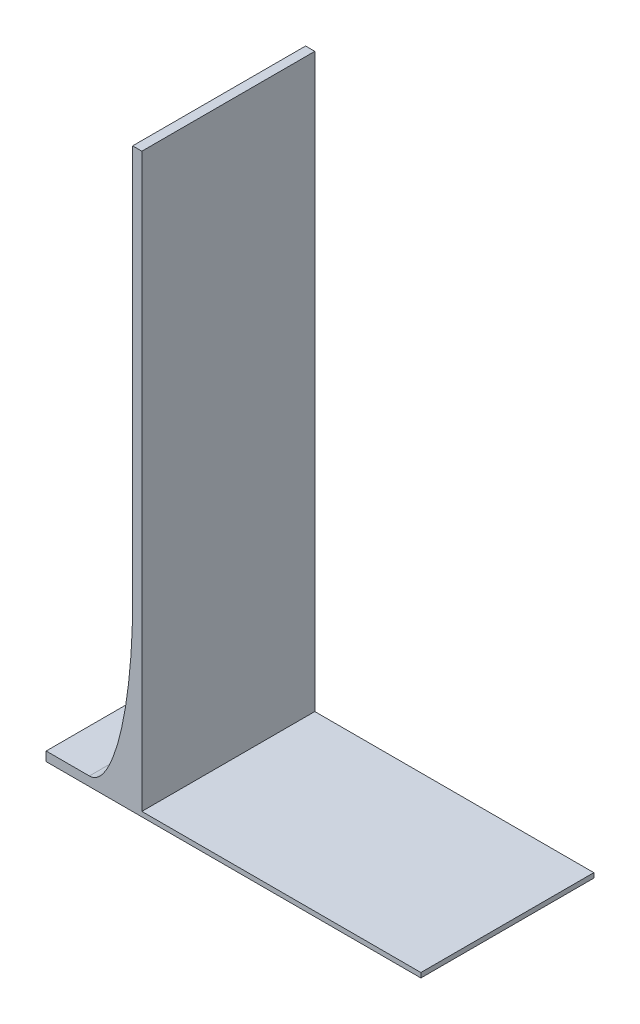
ISO-10303-21;
HEADER;
FILE_DESCRIPTION(('STEP AP214'),'2;1');
FILE_NAME('part.step','',(''),(''),'','','');
FILE_SCHEMA(('AUTOMOTIVE_DESIGN { 1 0 10303 214 1 1 1 1 }'));
ENDSEC;
DATA;
#1=APPLICATION_CONTEXT('core data for automotive mechanical design processes');
#2=APPLICATION_PROTOCOL_DEFINITION('international standard','automotive_design',2000,#1);
#3=PRODUCT_CONTEXT('',#1,'mechanical');
#4=PRODUCT('Part','Part','',(#3));
#5=PRODUCT_RELATED_PRODUCT_CATEGORY('part','',(#4));
#6=PRODUCT_DEFINITION_FORMATION('','',#4);
#7=PRODUCT_DEFINITION_CONTEXT('part definition',#1,'design');
#8=PRODUCT_DEFINITION('design','',#6,#7);
#9=PRODUCT_DEFINITION_SHAPE('','',#8);
#10=(LENGTH_UNIT() NAMED_UNIT(*) SI_UNIT(.MILLI.,.METRE.));
#11=(NAMED_UNIT(*) PLANE_ANGLE_UNIT() SI_UNIT($,.RADIAN.));
#12=(NAMED_UNIT(*) SI_UNIT($,.STERADIAN.) SOLID_ANGLE_UNIT());
#13=UNCERTAINTY_MEASURE_WITH_UNIT(LENGTH_MEASURE(1.E-05),#10,'distance_accuracy_value','');
#14=(GEOMETRIC_REPRESENTATION_CONTEXT(3) GLOBAL_UNCERTAINTY_ASSIGNED_CONTEXT((#13)) GLOBAL_UNIT_ASSIGNED_CONTEXT((#10,
#11,#12)) REPRESENTATION_CONTEXT('',''));
#15=CARTESIAN_POINT('',(0.,0.,0.));
#16=DIRECTION('',(0.,0.,1.));
#17=DIRECTION('',(1.,0.,0.));
#18=AXIS2_PLACEMENT_3D('',#15,#16,#17);
#19=CARTESIAN_POINT('',(0.,1.65,60.));
#20=DIRECTION('',(0.,1.,0.));
#21=DIRECTION('',(0.,0.,1.));
#22=AXIS2_PLACEMENT_3D('',#19,#20,#21);
#23=PLANE('',#22);
#24=DIRECTION('',(1.,0.,0.));
#25=VECTOR('',#24,1.);
#26=CARTESIAN_POINT('',(0.,1.65,0.));
#27=LINE('',#26,#25);
#28=CARTESIAN_POINT('',(3.2,1.65,0.));
#29=VERTEX_POINT('',#28);
#30=CARTESIAN_POINT('',(100.,1.65,0.));
#31=VERTEX_POINT('',#30);
#32=EDGE_CURVE('E256',#29,#31,#27,.T.);
#33=ORIENTED_EDGE('',*,*,#32,.F.);
#34=DIRECTION('',(0.,0.,1.));
#35=VECTOR('',#34,1.);
#36=CARTESIAN_POINT('',(3.2,1.65,60.));
#37=LINE('',#36,#35);
#38=CARTESIAN_POINT('',(3.2,1.65,60.));
#39=VERTEX_POINT('',#38);
#40=EDGE_CURVE('E163',#29,#39,#37,.T.);
#41=ORIENTED_EDGE('',*,*,#40,.T.);
#42=DIRECTION('',(1.,0.,0.));
#43=VECTOR('',#42,1.);
#44=CARTESIAN_POINT('',(0.,1.65,60.));
#45=LINE('',#44,#43);
#46=CARTESIAN_POINT('',(100.,1.65,60.));
#47=VERTEX_POINT('',#46);
#48=EDGE_CURVE('E262',#39,#47,#45,.T.);
#49=ORIENTED_EDGE('',*,*,#48,.T.);
#50=DIRECTION('',(0.,0.,-1.));
#51=VECTOR('',#50,1.);
#52=CARTESIAN_POINT('',(100.,1.65,60.));
#53=LINE('',#52,#51);
#54=EDGE_CURVE('E253',#47,#31,#53,.T.);
#55=ORIENTED_EDGE('',*,*,#54,.T.);
#56=EDGE_LOOP('',(#33,#41,#49,#55));
#57=FACE_BOUND('',#56,.T.);
#58=ADVANCED_FACE('F66',(#57),#23,.T.);
#59=CARTESIAN_POINT('',(0.,0.,60.));
#60=DIRECTION('',(0.,1.,0.));
#61=DIRECTION('',(0.,0.,1.));
#62=AXIS2_PLACEMENT_3D('',#59,#60,#61);
#63=PLANE('',#62);
#64=DIRECTION('',(1.,0.,0.));
#65=VECTOR('',#64,1.);
#66=CARTESIAN_POINT('',(0.,0.,0.));
#67=LINE('',#66,#65);
#68=CARTESIAN_POINT('',(-30.,0.,0.));
#69=VERTEX_POINT('',#68);
#70=CARTESIAN_POINT('',(100.,0.,0.));
#71=VERTEX_POINT('',#70);
#72=EDGE_CURVE('E243',#69,#71,#67,.T.);
#73=ORIENTED_EDGE('',*,*,#72,.T.);
#74=DIRECTION('',(0.,0.,-1.));
#75=VECTOR('',#74,1.);
#76=CARTESIAN_POINT('',(100.,0.,60.));
#77=LINE('',#76,#75);
#78=CARTESIAN_POINT('',(100.,0.,60.));
#79=VERTEX_POINT('',#78);
#80=EDGE_CURVE('E179',#79,#71,#77,.T.);
#81=ORIENTED_EDGE('',*,*,#80,.F.);
#82=DIRECTION('',(1.,0.,0.));
#83=VECTOR('',#82,1.);
#84=CARTESIAN_POINT('',(0.,0.,60.));
#85=LINE('',#84,#83);
#86=CARTESIAN_POINT('',(-30.,0.,60.));
#87=VERTEX_POINT('',#86);
#88=EDGE_CURVE('E259',#87,#79,#85,.T.);
#89=ORIENTED_EDGE('',*,*,#88,.F.);
#90=DIRECTION('',(0.,0.,-1.));
#91=VECTOR('',#90,1.);
#92=CARTESIAN_POINT('',(-30.,0.,60.));
#93=LINE('',#92,#91);
#94=EDGE_CURVE('E164',#87,#69,#93,.T.);
#95=ORIENTED_EDGE('',*,*,#94,.T.);
#96=EDGE_LOOP('',(#73,#81,#89,#95));
#97=FACE_BOUND('',#96,.T.);
#98=ADVANCED_FACE('F233',(#97),#63,.F.);
#99=CARTESIAN_POINT('',(100.,1.65,60.));
#100=DIRECTION('',(1.,0.,0.));
#101=DIRECTION('',(0.,0.,-1.));
#102=AXIS2_PLACEMENT_3D('',#99,#100,#101);
#103=PLANE('',#102);
#104=DIRECTION('',(0.,-1.,0.));
#105=VECTOR('',#104,1.);
#106=CARTESIAN_POINT('',(100.,1.65,0.));
#107=LINE('',#106,#105);
#108=EDGE_CURVE('E247',#31,#71,#107,.T.);
#109=ORIENTED_EDGE('',*,*,#108,.F.);
#110=ORIENTED_EDGE('',*,*,#54,.F.);
#111=DIRECTION('',(0.,-1.,0.));
#112=VECTOR('',#111,1.);
#113=CARTESIAN_POINT('',(100.,1.65,60.));
#114=LINE('',#113,#112);
#115=EDGE_CURVE('E252',#47,#79,#114,.T.);
#116=ORIENTED_EDGE('',*,*,#115,.T.);
#117=ORIENTED_EDGE('',*,*,#80,.T.);
#118=EDGE_LOOP('',(#109,#110,#116,#117));
#119=FACE_BOUND('',#118,.T.);
#120=ADVANCED_FACE('F235',(#119),#103,.T.);
#121=CARTESIAN_POINT('',(0.,0.,60.));
#122=DIRECTION('',(0.,0.,-1.));
#123=DIRECTION('',(-1.,0.,0.));
#124=AXIS2_PLACEMENT_3D('',#121,#122,#123);
#125=PLANE('',#124);
#126=ORIENTED_EDGE('',*,*,#48,.F.);
#127=DIRECTION('',(0.,1.,0.));
#128=VECTOR('',#127,1.);
#129=CARTESIAN_POINT('',(3.2,0.,60.));
#130=LINE('',#129,#128);
#131=CARTESIAN_POINT('',(3.2,200.,60.));
#132=VERTEX_POINT('',#131);
#133=EDGE_CURVE('E278',#39,#132,#130,.T.);
#134=ORIENTED_EDGE('',*,*,#133,.T.);
#135=DIRECTION('',(1.,0.,0.));
#136=VECTOR('',#135,1.);
#137=CARTESIAN_POINT('',(0.,200.,60.));
#138=LINE('',#137,#136);
#139=CARTESIAN_POINT('',(0.,200.,60.));
#140=VERTEX_POINT('',#139);
#141=EDGE_CURVE('E280',#140,#132,#138,.T.);
#142=ORIENTED_EDGE('',*,*,#141,.F.);
#143=DIRECTION('',(0.,1.,0.));
#144=VECTOR('',#143,1.);
#145=CARTESIAN_POINT('',(0.,0.,60.));
#146=LINE('',#145,#144);
#147=CARTESIAN_POINT('',(0.,63.2,60.));
#148=VERTEX_POINT('',#147);
#149=EDGE_CURVE('E188',#148,#140,#146,.T.);
#150=ORIENTED_EDGE('',*,*,#149,.F.);
#151=CARTESIAN_POINT('',(-15.,3.2,60.));
#152=CARTESIAN_POINT('',(0.,3.2,60.));
#153=CARTESIAN_POINT('',(0.,63.2,60.));
#154=(BOUNDED_CURVE() B_SPLINE_CURVE(2,(#151,#152,#153),.UNSPECIFIED.,.F.,
.F.) B_SPLINE_CURVE_WITH_KNOTS((3,3),(0.,1.),
.UNSPECIFIED.) CURVE() GEOMETRIC_REPRESENTATION_ITEM() RATIONAL_B_SPLINE_CURVE((1.,
0.707106781186548,1.)) REPRESENTATION_ITEM(''));
#155=CARTESIAN_POINT('',(-15.,3.2,60.));
#156=VERTEX_POINT('',#155);
#157=EDGE_CURVE('E13',#148,#156,#154,.F.);
#158=ORIENTED_EDGE('',*,*,#157,.T.);
#159=DIRECTION('',(-1.,0.,0.));
#160=VECTOR('',#159,1.);
#161=CARTESIAN_POINT('',(0.,3.2,60.));
#162=LINE('',#161,#160);
#163=CARTESIAN_POINT('',(-30.,3.2,60.));
#164=VERTEX_POINT('',#163);
#165=EDGE_CURVE('E143',#156,#164,#162,.T.);
#166=ORIENTED_EDGE('',*,*,#165,.T.);
#167=DIRECTION('',(0.,1.,0.));
#168=VECTOR('',#167,1.);
#169=CARTESIAN_POINT('',(-30.,0.,60.));
#170=LINE('',#169,#168);
#171=EDGE_CURVE('E148',#87,#164,#170,.T.);
#172=ORIENTED_EDGE('',*,*,#171,.F.);
#173=ORIENTED_EDGE('',*,*,#88,.T.);
#174=ORIENTED_EDGE('',*,*,#115,.F.);
#175=EDGE_LOOP('',(#126,#134,#142,#150,#158,#166,#172,#173,#174));
#176=FACE_BOUND('',#175,.T.);
#177=ADVANCED_FACE('F146',(#176),#125,.F.);
#178=CARTESIAN_POINT('',(0.,0.,0.));
#179=DIRECTION('',(0.,0.,-1.));
#180=DIRECTION('',(-1.,0.,0.));
#181=AXIS2_PLACEMENT_3D('',#178,#179,#180);
#182=PLANE('',#181);
#183=DIRECTION('',(0.,1.,0.));
#184=VECTOR('',#183,1.);
#185=CARTESIAN_POINT('',(3.2,0.,0.));
#186=LINE('',#185,#184);
#187=CARTESIAN_POINT('',(3.2,200.,0.));
#188=VERTEX_POINT('',#187);
#189=EDGE_CURVE('E282',#29,#188,#186,.T.);
#190=ORIENTED_EDGE('',*,*,#189,.F.);
#191=ORIENTED_EDGE('',*,*,#32,.T.);
#192=ORIENTED_EDGE('',*,*,#108,.T.);
#193=ORIENTED_EDGE('',*,*,#72,.F.);
#194=DIRECTION('',(0.,1.,0.));
#195=VECTOR('',#194,1.);
#196=CARTESIAN_POINT('',(-30.,0.,0.));
#197=LINE('',#196,#195);
#198=CARTESIAN_POINT('',(-30.,3.2,0.));
#199=VERTEX_POINT('',#198);
#200=EDGE_CURVE('E154',#69,#199,#197,.T.);
#201=ORIENTED_EDGE('',*,*,#200,.T.);
#202=DIRECTION('',(-1.,0.,0.));
#203=VECTOR('',#202,1.);
#204=CARTESIAN_POINT('',(0.,3.2,0.));
#205=LINE('',#204,#203);
#206=CARTESIAN_POINT('',(-15.,3.2,0.));
#207=VERTEX_POINT('',#206);
#208=EDGE_CURVE('E159',#207,#199,#205,.T.);
#209=ORIENTED_EDGE('',*,*,#208,.F.);
#210=CARTESIAN_POINT('',(0.,63.2,0.));
#211=CARTESIAN_POINT('',(0.,3.2,0.));
#212=CARTESIAN_POINT('',(-15.,3.2,0.));
#213=(BOUNDED_CURVE() B_SPLINE_CURVE(2,(#210,#211,#212),.UNSPECIFIED.,.F.,
.F.) B_SPLINE_CURVE_WITH_KNOTS((3,3),(0.,1.),
.UNSPECIFIED.) CURVE() GEOMETRIC_REPRESENTATION_ITEM() RATIONAL_B_SPLINE_CURVE((1.,
0.707106781186548,1.)) REPRESENTATION_ITEM(''));
#214=CARTESIAN_POINT('',(0.,63.2,0.));
#215=VERTEX_POINT('',#214);
#216=EDGE_CURVE('E80',#207,#215,#213,.F.);
#217=ORIENTED_EDGE('',*,*,#216,.T.);
#218=DIRECTION('',(0.,1.,0.));
#219=VECTOR('',#218,1.);
#220=CARTESIAN_POINT('',(0.,0.,0.));
#221=LINE('',#220,#219);
#222=CARTESIAN_POINT('',(0.,200.,0.));
#223=VERTEX_POINT('',#222);
#224=EDGE_CURVE('E277',#215,#223,#221,.T.);
#225=ORIENTED_EDGE('',*,*,#224,.T.);
#226=DIRECTION('',(1.,0.,0.));
#227=VECTOR('',#226,1.);
#228=CARTESIAN_POINT('',(0.,200.,0.));
#229=LINE('',#228,#227);
#230=EDGE_CURVE('E275',#223,#188,#229,.T.);
#231=ORIENTED_EDGE('',*,*,#230,.T.);
#232=EDGE_LOOP('',(#190,#191,#192,#193,#201,#209,#217,#225,#231));
#233=FACE_BOUND('',#232,.T.);
#234=ADVANCED_FACE('F220',(#233),#182,.T.);
#235=CARTESIAN_POINT('',(-30.,0.,60.));
#236=DIRECTION('',(-1.,0.,0.));
#237=DIRECTION('',(0.,0.,1.));
#238=AXIS2_PLACEMENT_3D('',#235,#236,#237);
#239=PLANE('',#238);
#240=ORIENTED_EDGE('',*,*,#200,.F.);
#241=ORIENTED_EDGE('',*,*,#94,.F.);
#242=ORIENTED_EDGE('',*,*,#171,.T.);
#243=DIRECTION('',(0.,0.,-1.));
#244=VECTOR('',#243,1.);
#245=CARTESIAN_POINT('',(-30.,3.2,60.));
#246=LINE('',#245,#244);
#247=EDGE_CURVE('E157',#164,#199,#246,.T.);
#248=ORIENTED_EDGE('',*,*,#247,.T.);
#249=EDGE_LOOP('',(#240,#241,#242,#248));
#250=FACE_BOUND('',#249,.T.);
#251=ADVANCED_FACE('F167',(#250),#239,.T.);
#252=CARTESIAN_POINT('',(0.,3.2,60.));
#253=DIRECTION('',(0.,-1.,0.));
#254=DIRECTION('',(1.,0.,0.));
#255=AXIS2_PLACEMENT_3D('',#252,#253,#254);
#256=PLANE('',#255);
#257=ORIENTED_EDGE('',*,*,#165,.F.);
#258=CARTESIAN_POINT('',(-15.,3.2,-3.));
#259=CARTESIAN_POINT('',(-15.,3.2,19.));
#260=CARTESIAN_POINT('',(-15.,3.2,41.));
#261=CARTESIAN_POINT('',(-15.,3.2,63.));
#262=(BOUNDED_CURVE() B_SPLINE_CURVE(3,(#258,#259,#260,#261),.UNSPECIFIED.,.F.,
.F.) B_SPLINE_CURVE_WITH_KNOTS((4,4),(-0.003,0.063),
.UNSPECIFIED.) CURVE() GEOMETRIC_REPRESENTATION_ITEM() RATIONAL_B_SPLINE_CURVE((1.,1.,1.,1.)) REPRESENTATION_ITEM(''));
#263=EDGE_CURVE('E183',#156,#207,#262,.F.);
#264=ORIENTED_EDGE('',*,*,#263,.T.);
#265=ORIENTED_EDGE('',*,*,#208,.T.);
#266=ORIENTED_EDGE('',*,*,#247,.F.);
#267=EDGE_LOOP('',(#257,#264,#265,#266));
#268=FACE_BOUND('',#267,.T.);
#269=ADVANCED_FACE('F158',(#268),#256,.F.);
#270=CARTESIAN_POINT('',(3.2,0.,60.));
#271=DIRECTION('',(-1.,0.,0.));
#272=DIRECTION('',(0.,0.,1.));
#273=AXIS2_PLACEMENT_3D('',#270,#271,#272);
#274=PLANE('',#273);
#275=ORIENTED_EDGE('',*,*,#40,.F.);
#276=ORIENTED_EDGE('',*,*,#189,.T.);
#277=DIRECTION('',(0.,0.,-1.));
#278=VECTOR('',#277,1.);
#279=CARTESIAN_POINT('',(3.2,200.,60.));
#280=LINE('',#279,#278);
#281=EDGE_CURVE('E178',#132,#188,#280,.T.);
#282=ORIENTED_EDGE('',*,*,#281,.F.);
#283=ORIENTED_EDGE('',*,*,#133,.F.);
#284=EDGE_LOOP('',(#275,#276,#282,#283));
#285=FACE_BOUND('',#284,.T.);
#286=ADVANCED_FACE('F200',(#285),#274,.F.);
#287=CARTESIAN_POINT('',(0.,200.,60.));
#288=DIRECTION('',(0.,1.,0.));
#289=DIRECTION('',(0.,0.,1.));
#290=AXIS2_PLACEMENT_3D('',#287,#288,#289);
#291=PLANE('',#290);
#292=ORIENTED_EDGE('',*,*,#230,.F.);
#293=DIRECTION('',(0.,0.,-1.));
#294=VECTOR('',#293,1.);
#295=CARTESIAN_POINT('',(0.,200.,60.));
#296=LINE('',#295,#294);
#297=EDGE_CURVE('E270',#140,#223,#296,.T.);
#298=ORIENTED_EDGE('',*,*,#297,.F.);
#299=ORIENTED_EDGE('',*,*,#141,.T.);
#300=ORIENTED_EDGE('',*,*,#281,.T.);
#301=EDGE_LOOP('',(#292,#298,#299,#300));
#302=FACE_BOUND('',#301,.T.);
#303=ADVANCED_FACE('F205',(#302),#291,.T.);
#304=CARTESIAN_POINT('',(0.,0.,60.));
#305=DIRECTION('',(-1.,0.,0.));
#306=DIRECTION('',(0.,0.,1.));
#307=AXIS2_PLACEMENT_3D('',#304,#305,#306);
#308=PLANE('',#307);
#309=ORIENTED_EDGE('',*,*,#224,.F.);
#310=CARTESIAN_POINT('',(0.,63.2,63.));
#311=CARTESIAN_POINT('',(0.,63.2,41.));
#312=CARTESIAN_POINT('',(0.,63.2,19.));
#313=CARTESIAN_POINT('',(0.,63.2,-3.));
#314=(BOUNDED_CURVE() B_SPLINE_CURVE(3,(#310,#311,#312,#313),.UNSPECIFIED.,.F.,
.F.) B_SPLINE_CURVE_WITH_KNOTS((4,4),(-0.003,0.063),
.UNSPECIFIED.) CURVE() GEOMETRIC_REPRESENTATION_ITEM() RATIONAL_B_SPLINE_CURVE((1.,1.,1.,1.)) REPRESENTATION_ITEM(''));
#315=EDGE_CURVE('E94',#215,#148,#314,.F.);
#316=ORIENTED_EDGE('',*,*,#315,.T.);
#317=ORIENTED_EDGE('',*,*,#149,.T.);
#318=ORIENTED_EDGE('',*,*,#297,.T.);
#319=EDGE_LOOP('',(#309,#316,#317,#318));
#320=FACE_BOUND('',#319,.T.);
#321=ADVANCED_FACE('F201',(#320),#308,.T.);
#322=CARTESIAN_POINT('',(-15.,3.2,63.));
#323=CARTESIAN_POINT('',(-15.,3.2,41.));
#324=CARTESIAN_POINT('',(-15.,3.2,19.));
#325=CARTESIAN_POINT('',(-15.,3.2,-3.));
#326=CARTESIAN_POINT('',(0.,3.2,63.));
#327=CARTESIAN_POINT('',(0.,3.2,41.));
#328=CARTESIAN_POINT('',(0.,3.2,19.));
#329=CARTESIAN_POINT('',(0.,3.2,-3.));
#330=CARTESIAN_POINT('',(0.,63.2,63.));
#331=CARTESIAN_POINT('',(0.,63.2,41.));
#332=CARTESIAN_POINT('',(0.,63.2,19.));
#333=CARTESIAN_POINT('',(0.,63.2,-3.));
#334=(BOUNDED_SURFACE() B_SPLINE_SURFACE(2,3,((#322,#323,#324,#325),(#326,#327,#328,#329),(#330,
#331,#332,#333)),.UNSPECIFIED.,.F.,.F.,.F.) B_SPLINE_SURFACE_WITH_KNOTS((3,3),(4,4),(0.,1.),
(-0.003,0.063),.UNSPECIFIED.) GEOMETRIC_REPRESENTATION_ITEM() RATIONAL_B_SPLINE_SURFACE(((1.,1.,
1.,1.),(0.707106781186548,0.707106781186548,0.707106781186548,0.707106781186548),(1.,1.,1.,1.))) REPRESENTATION_ITEM('') SURFACE());
#335=ORIENTED_EDGE('',*,*,#157,.F.);
#336=ORIENTED_EDGE('',*,*,#315,.F.);
#337=ORIENTED_EDGE('',*,*,#216,.F.);
#338=ORIENTED_EDGE('',*,*,#263,.F.);
#339=EDGE_LOOP('',(#335,#336,#337,#338));
#340=FACE_BOUND('',#339,.T.);
#341=ADVANCED_FACE('F69',(#340),#334,.T.);
#342=CLOSED_SHELL('',(#58,#98,#120,#177,#234,#251,#269,#286,#303,#321,#341));
#343=MANIFOLD_SOLID_BREP('B2',#342);
#344=ADVANCED_BREP_SHAPE_REPRESENTATION('',(#18,#343),#14);
#345=SHAPE_DEFINITION_REPRESENTATION(#9,#344);
ENDSEC;
END-ISO-10303-21;
